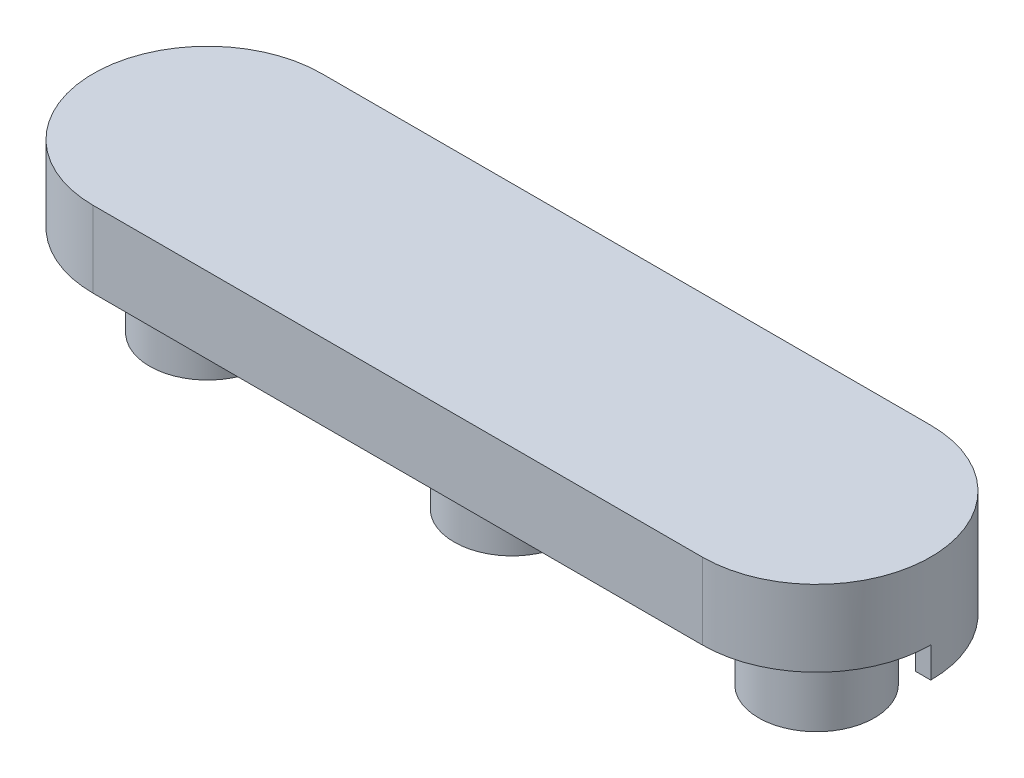
ISO-10303-21;
HEADER;
FILE_DESCRIPTION(('STEP AP214'),'2;1');
FILE_NAME('part.step','',(''),(''),'','','');
FILE_SCHEMA(('AUTOMOTIVE_DESIGN { 1 0 10303 214 1 1 1 1 }'));
ENDSEC;
DATA;
#1=APPLICATION_CONTEXT('core data for automotive mechanical design processes');
#2=APPLICATION_PROTOCOL_DEFINITION('international standard','automotive_design',2000,#1);
#3=PRODUCT_CONTEXT('',#1,'mechanical');
#4=PRODUCT('Part','Part','',(#3));
#5=PRODUCT_RELATED_PRODUCT_CATEGORY('part','',(#4));
#6=PRODUCT_DEFINITION_FORMATION('','',#4);
#7=PRODUCT_DEFINITION_CONTEXT('part definition',#1,'design');
#8=PRODUCT_DEFINITION('design','',#6,#7);
#9=PRODUCT_DEFINITION_SHAPE('','',#8);
#10=(LENGTH_UNIT() NAMED_UNIT(*) SI_UNIT(.MILLI.,.METRE.));
#11=(NAMED_UNIT(*) PLANE_ANGLE_UNIT() SI_UNIT($,.RADIAN.));
#12=(NAMED_UNIT(*) SI_UNIT($,.STERADIAN.) SOLID_ANGLE_UNIT());
#13=UNCERTAINTY_MEASURE_WITH_UNIT(LENGTH_MEASURE(1.E-05),#10,'distance_accuracy_value','');
#14=(GEOMETRIC_REPRESENTATION_CONTEXT(3) GLOBAL_UNCERTAINTY_ASSIGNED_CONTEXT((#13)) GLOBAL_UNIT_ASSIGNED_CONTEXT((#10,
#11,#12)) REPRESENTATION_CONTEXT('',''));
#15=CARTESIAN_POINT('',(0.,0.,0.));
#16=DIRECTION('',(0.,0.,1.));
#17=DIRECTION('',(1.,0.,0.));
#18=AXIS2_PLACEMENT_3D('',#15,#16,#17);
#19=CARTESIAN_POINT('',(-25.4,7.62,0.));
#20=DIRECTION('',(0.,1.,0.));
#21=DIRECTION('',(0.,0.,1.));
#22=AXIS2_PLACEMENT_3D('',#19,#20,#21);
#23=PLANE('',#22);
#24=CARTESIAN_POINT('',(-25.4,7.62,0.));
#25=DIRECTION('',(0.,1.,0.));
#26=DIRECTION('',(0.,0.,1.));
#27=AXIS2_PLACEMENT_3D('',#24,#25,#26);
#28=CIRCLE('',#27,4.826);
#29=CARTESIAN_POINT('',(-25.4,7.62,4.826));
#30=VERTEX_POINT('',#29);
#31=EDGE_CURVE('E160',#30,#30,#28,.F.);
#32=ORIENTED_EDGE('',*,*,#31,.F.);
#33=EDGE_LOOP('',(#32));
#34=FACE_BOUND('',#33,.T.);
#35=CARTESIAN_POINT('',(0.,7.62,0.));
#36=DIRECTION('',(0.,1.,0.));
#37=DIRECTION('',(0.,0.,1.));
#38=AXIS2_PLACEMENT_3D('',#35,#36,#37);
#39=CIRCLE('',#38,4.826);
#40=CARTESIAN_POINT('',(0.,7.62,4.826));
#41=VERTEX_POINT('',#40);
#42=EDGE_CURVE('E168',#41,#41,#39,.F.);
#43=ORIENTED_EDGE('',*,*,#42,.F.);
#44=EDGE_LOOP('',(#43));
#45=FACE_BOUND('',#44,.T.);
#46=CARTESIAN_POINT('',(25.4,7.62,0.));
#47=DIRECTION('',(0.,1.,0.));
#48=DIRECTION('',(0.,0.,1.));
#49=AXIS2_PLACEMENT_3D('',#46,#47,#48);
#50=CIRCLE('',#49,4.826);
#51=CARTESIAN_POINT('',(25.4,7.62,4.826));
#52=VERTEX_POINT('',#51);
#53=EDGE_CURVE('E12',#52,#52,#50,.F.);
#54=ORIENTED_EDGE('',*,*,#53,.F.);
#55=EDGE_LOOP('',(#54));
#56=FACE_BOUND('',#55,.T.);
#57=DIRECTION('',(-1.,0.,0.));
#58=VECTOR('',#57,1.);
#59=CARTESIAN_POINT('',(34.925,7.62,0.));
#60=LINE('',#59,#58);
#61=CARTESIAN_POINT('',(34.925,7.62,0.));
#62=VERTEX_POINT('',#61);
#63=CARTESIAN_POINT('',(33.655,7.62,0.));
#64=VERTEX_POINT('',#63);
#65=EDGE_CURVE('E544',#62,#64,#60,.T.);
#66=ORIENTED_EDGE('',*,*,#65,.F.);
#67=CARTESIAN_POINT('',(25.4,7.62,0.));
#68=DIRECTION('',(0.,1.,0.));
#69=DIRECTION('',(0.,0.,1.));
#70=AXIS2_PLACEMENT_3D('',#67,#68,#69);
#71=CIRCLE('',#70,9.525);
#72=CARTESIAN_POINT('',(25.4,7.62,9.525));
#73=VERTEX_POINT('',#72);
#74=EDGE_CURVE('E151',#73,#62,#71,.T.);
#75=ORIENTED_EDGE('',*,*,#74,.F.);
#76=DIRECTION('',(1.,0.,0.));
#77=VECTOR('',#76,1.);
#78=CARTESIAN_POINT('',(-25.4,7.62,9.525));
#79=LINE('',#78,#77);
#80=CARTESIAN_POINT('',(-25.4,7.62,9.525));
#81=VERTEX_POINT('',#80);
#82=EDGE_CURVE('E135',#81,#73,#79,.T.);
#83=ORIENTED_EDGE('',*,*,#82,.F.);
#84=CARTESIAN_POINT('',(-25.4,7.62,0.));
#85=DIRECTION('',(0.,1.,0.));
#86=DIRECTION('',(0.,0.,1.));
#87=AXIS2_PLACEMENT_3D('',#84,#85,#86);
#88=CIRCLE('',#87,9.525);
#89=CARTESIAN_POINT('',(-34.925,7.62,0.));
#90=VERTEX_POINT('',#89);
#91=EDGE_CURVE('E84',#90,#81,#88,.T.);
#92=ORIENTED_EDGE('',*,*,#91,.F.);
#93=DIRECTION('',(-1.,0.,0.));
#94=VECTOR('',#93,1.);
#95=CARTESIAN_POINT('',(-33.655,7.62,0.));
#96=LINE('',#95,#94);
#97=CARTESIAN_POINT('',(-33.655,7.62,0.));
#98=VERTEX_POINT('',#97);
#99=EDGE_CURVE('E518',#98,#90,#96,.T.);
#100=ORIENTED_EDGE('',*,*,#99,.F.);
#101=CARTESIAN_POINT('',(-25.4,7.62,0.));
#102=DIRECTION('',(0.,1.,0.));
#103=DIRECTION('',(0.,0.,1.));
#104=AXIS2_PLACEMENT_3D('',#101,#102,#103);
#105=CIRCLE('',#104,8.255);
#106=CARTESIAN_POINT('',(-25.4,7.62,-8.255));
#107=VERTEX_POINT('',#106);
#108=EDGE_CURVE('E538',#107,#98,#105,.T.);
#109=ORIENTED_EDGE('',*,*,#108,.F.);
#110=DIRECTION('',(-1.,0.,0.));
#111=VECTOR('',#110,1.);
#112=CARTESIAN_POINT('',(25.4,7.62,-8.255));
#113=LINE('',#112,#111);
#114=CARTESIAN_POINT('',(25.4,7.62,-8.255));
#115=VERTEX_POINT('',#114);
#116=EDGE_CURVE('E540',#115,#107,#113,.T.);
#117=ORIENTED_EDGE('',*,*,#116,.F.);
#118=CARTESIAN_POINT('',(25.4,7.62,0.));
#119=DIRECTION('',(0.,1.,0.));
#120=DIRECTION('',(0.,0.,-1.));
#121=AXIS2_PLACEMENT_3D('',#118,#119,#120);
#122=CIRCLE('',#121,8.255);
#123=EDGE_CURVE('E542',#64,#115,#122,.T.);
#124=ORIENTED_EDGE('',*,*,#123,.F.);
#125=EDGE_LOOP('',(#66,#75,#83,#92,#100,#109,#117,#124));
#126=FACE_BOUND('',#125,.T.);
#127=ADVANCED_FACE('F55',(#34,#45,#56,#126),#23,.F.);
#128=CARTESIAN_POINT('',(-25.4,7.62,0.));
#129=DIRECTION('',(0.,1.,0.));
#130=DIRECTION('',(0.,0.,1.));
#131=AXIS2_PLACEMENT_3D('',#128,#129,#130);
#132=CIRCLE('',#131,2.0955);
#133=CARTESIAN_POINT('',(-25.4,7.62,2.0955));
#134=VERTEX_POINT('',#133);
#135=EDGE_CURVE('E157',#134,#134,#132,.T.);
#136=ORIENTED_EDGE('',*,*,#135,.T.);
#137=EDGE_LOOP('',(#136));
#138=FACE_BOUND('',#137,.T.);
#139=CARTESIAN_POINT('',(-25.4,7.62,0.));
#140=DIRECTION('',(0.,1.,0.));
#141=DIRECTION('',(0.,0.,1.));
#142=AXIS2_PLACEMENT_3D('',#139,#140,#141);
#143=CIRCLE('',#142,3.1115);
#144=CARTESIAN_POINT('',(-25.4,7.62,3.1115));
#145=VERTEX_POINT('',#144);
#146=EDGE_CURVE('E149',#145,#145,#143,.T.);
#147=ORIENTED_EDGE('',*,*,#146,.F.);
#148=EDGE_LOOP('',(#147));
#149=FACE_BOUND('',#148,.T.);
#150=ADVANCED_FACE('F237',(#138,#149),#23,.F.);
#151=CARTESIAN_POINT('',(-25.4,7.62,0.));
#152=DIRECTION('',(0.,-1.,0.));
#153=DIRECTION('',(0.,0.,-1.));
#154=AXIS2_PLACEMENT_3D('',#151,#152,#153);
#155=CYLINDRICAL_SURFACE('',#154,2.0955);
#156=ORIENTED_EDGE('',*,*,#135,.F.);
#157=EDGE_LOOP('',(#156));
#158=FACE_BOUND('',#157,.T.);
#159=CARTESIAN_POINT('',(-25.4,0.,0.));
#160=DIRECTION('',(0.,1.,0.));
#161=DIRECTION('',(0.,0.,1.));
#162=AXIS2_PLACEMENT_3D('',#159,#160,#161);
#163=CIRCLE('',#162,2.0955);
#164=CARTESIAN_POINT('',(-25.4,0.,2.0955));
#165=VERTEX_POINT('',#164);
#166=EDGE_CURVE('E156',#165,#165,#163,.T.);
#167=ORIENTED_EDGE('',*,*,#166,.T.);
#168=EDGE_LOOP('',(#167));
#169=FACE_BOUND('',#168,.T.);
#170=ADVANCED_FACE('F57',(#158,#169),#155,.T.);
#171=CARTESIAN_POINT('',(0.,0.,0.));
#172=DIRECTION('',(0.,1.,0.));
#173=DIRECTION('',(0.,0.,1.));
#174=AXIS2_PLACEMENT_3D('',#171,#172,#173);
#175=PLANE('',#174);
#176=ORIENTED_EDGE('',*,*,#166,.F.);
#177=EDGE_LOOP('',(#176));
#178=FACE_BOUND('',#177,.T.);
#179=ADVANCED_FACE('F257',(#178),#175,.F.);
#180=CARTESIAN_POINT('',(-25.4,7.62,0.));
#181=DIRECTION('',(0.,-1.,0.));
#182=DIRECTION('',(0.,0.,-1.));
#183=AXIS2_PLACEMENT_3D('',#180,#181,#182);
#184=CYLINDRICAL_SURFACE('',#183,3.1115);
#185=ORIENTED_EDGE('',*,*,#146,.T.);
#186=EDGE_LOOP('',(#185));
#187=FACE_BOUND('',#186,.T.);
#188=CARTESIAN_POINT('',(-25.4,0.,0.));
#189=DIRECTION('',(0.,1.,0.));
#190=DIRECTION('',(0.,0.,1.));
#191=AXIS2_PLACEMENT_3D('',#188,#189,#190);
#192=CIRCLE('',#191,3.1115);
#193=CARTESIAN_POINT('',(-25.4,0.,3.1115));
#194=VERTEX_POINT('',#193);
#195=EDGE_CURVE('E212',#194,#194,#192,.T.);
#196=ORIENTED_EDGE('',*,*,#195,.F.);
#197=EDGE_LOOP('',(#196));
#198=FACE_BOUND('',#197,.T.);
#199=ADVANCED_FACE('F232',(#187,#198),#184,.F.);
#200=CARTESIAN_POINT('',(-25.4,7.62,0.));
#201=DIRECTION('',(0.,-1.,0.));
#202=DIRECTION('',(0.,0.,-1.));
#203=AXIS2_PLACEMENT_3D('',#200,#201,#202);
#204=CYLINDRICAL_SURFACE('',#203,4.826);
#205=ORIENTED_EDGE('',*,*,#31,.T.);
#206=EDGE_LOOP('',(#205));
#207=FACE_BOUND('',#206,.T.);
#208=CARTESIAN_POINT('',(-25.4,0.,0.));
#209=DIRECTION('',(0.,1.,0.));
#210=DIRECTION('',(0.,0.,1.));
#211=AXIS2_PLACEMENT_3D('',#208,#209,#210);
#212=CIRCLE('',#211,4.826);
#213=CARTESIAN_POINT('',(-25.4,0.,4.826));
#214=VERTEX_POINT('',#213);
#215=EDGE_CURVE('E215',#214,#214,#212,.T.);
#216=ORIENTED_EDGE('',*,*,#215,.T.);
#217=EDGE_LOOP('',(#216));
#218=FACE_BOUND('',#217,.T.);
#219=ADVANCED_FACE('F221',(#207,#218),#204,.T.);
#220=CARTESIAN_POINT('',(0.,0.,0.));
#221=DIRECTION('',(0.,1.,0.));
#222=DIRECTION('',(0.,0.,1.));
#223=AXIS2_PLACEMENT_3D('',#220,#221,#222);
#224=PLANE('',#223);
#225=ORIENTED_EDGE('',*,*,#195,.T.);
#226=EDGE_LOOP('',(#225));
#227=FACE_BOUND('',#226,.T.);
#228=ORIENTED_EDGE('',*,*,#215,.F.);
#229=EDGE_LOOP('',(#228));
#230=FACE_BOUND('',#229,.T.);
#231=ADVANCED_FACE('F223',(#227,#230),#224,.F.);
#232=CARTESIAN_POINT('',(-25.4,13.97,0.));
#233=DIRECTION('',(0.,1.,0.));
#234=DIRECTION('',(0.,0.,1.));
#235=AXIS2_PLACEMENT_3D('',#232,#233,#234);
#236=PLANE('',#235);
#237=CARTESIAN_POINT('',(-25.4,13.97,0.));
#238=DIRECTION('',(0.,1.,0.));
#239=DIRECTION('',(0.,0.,1.));
#240=AXIS2_PLACEMENT_3D('',#237,#238,#239);
#241=CIRCLE('',#240,9.525);
#242=CARTESIAN_POINT('',(-25.4,13.97,-9.525));
#243=VERTEX_POINT('',#242);
#244=CARTESIAN_POINT('',(-25.4,13.97,9.525));
#245=VERTEX_POINT('',#244);
#246=EDGE_CURVE('E128',#243,#245,#241,.T.);
#247=ORIENTED_EDGE('',*,*,#246,.T.);
#248=DIRECTION('',(1.,0.,0.));
#249=VECTOR('',#248,1.);
#250=CARTESIAN_POINT('',(-25.4,13.97,9.525));
#251=LINE('',#250,#249);
#252=CARTESIAN_POINT('',(25.4,13.97,9.525));
#253=VERTEX_POINT('',#252);
#254=EDGE_CURVE('E122',#245,#253,#251,.T.);
#255=ORIENTED_EDGE('',*,*,#254,.T.);
#256=CARTESIAN_POINT('',(25.4,13.97,0.));
#257=DIRECTION('',(0.,1.,0.));
#258=DIRECTION('',(0.,0.,1.));
#259=AXIS2_PLACEMENT_3D('',#256,#257,#258);
#260=CIRCLE('',#259,9.525);
#261=CARTESIAN_POINT('',(25.4,13.97,-9.525));
#262=VERTEX_POINT('',#261);
#263=EDGE_CURVE('E126',#253,#262,#260,.T.);
#264=ORIENTED_EDGE('',*,*,#263,.T.);
#265=DIRECTION('',(-1.,0.,0.));
#266=VECTOR('',#265,1.);
#267=CARTESIAN_POINT('',(-25.4,13.97,-9.525));
#268=LINE('',#267,#266);
#269=EDGE_CURVE('E72',#262,#243,#268,.T.);
#270=ORIENTED_EDGE('',*,*,#269,.T.);
#271=EDGE_LOOP('',(#247,#255,#264,#270));
#272=FACE_BOUND('',#271,.T.);
#273=ADVANCED_FACE('F124',(#272),#236,.T.);
#274=CARTESIAN_POINT('',(-25.4,13.97,9.525));
#275=DIRECTION('',(0.,0.,-1.));
#276=DIRECTION('',(-1.,0.,0.));
#277=AXIS2_PLACEMENT_3D('',#274,#275,#276);
#278=PLANE('',#277);
#279=ORIENTED_EDGE('',*,*,#82,.T.);
#280=DIRECTION('',(0.,-1.,0.));
#281=VECTOR('',#280,1.);
#282=CARTESIAN_POINT('',(25.4,13.97,9.525));
#283=LINE('',#282,#281);
#284=EDGE_CURVE('E133',#253,#73,#283,.T.);
#285=ORIENTED_EDGE('',*,*,#284,.F.);
#286=ORIENTED_EDGE('',*,*,#254,.F.);
#287=DIRECTION('',(0.,-1.,0.));
#288=VECTOR('',#287,1.);
#289=CARTESIAN_POINT('',(-25.4,13.97,9.525));
#290=LINE('',#289,#288);
#291=EDGE_CURVE('E139',#245,#81,#290,.T.);
#292=ORIENTED_EDGE('',*,*,#291,.T.);
#293=EDGE_LOOP('',(#279,#285,#286,#292));
#294=FACE_BOUND('',#293,.T.);
#295=ADVANCED_FACE('F134',(#294),#278,.F.);
#296=CARTESIAN_POINT('',(25.4,13.97,0.));
#297=DIRECTION('',(0.,-1.,0.));
#298=DIRECTION('',(0.,0.,-1.));
#299=AXIS2_PLACEMENT_3D('',#296,#297,#298);
#300=CYLINDRICAL_SURFACE('',#299,9.525);
#301=ORIENTED_EDGE('',*,*,#74,.T.);
#302=DIRECTION('',(0.,1.,0.));
#303=VECTOR('',#302,1.);
#304=CARTESIAN_POINT('',(34.925,5.08,0.));
#305=LINE('',#304,#303);
#306=CARTESIAN_POINT('',(34.925,5.08,0.));
#307=VERTEX_POINT('',#306);
#308=EDGE_CURVE('E197',#307,#62,#305,.T.);
#309=ORIENTED_EDGE('',*,*,#308,.F.);
#310=CARTESIAN_POINT('',(25.4,5.08,0.));
#311=DIRECTION('',(0.,-1.,0.));
#312=DIRECTION('',(0.,0.,-1.));
#313=AXIS2_PLACEMENT_3D('',#310,#311,#312);
#314=CIRCLE('',#313,9.525);
#315=CARTESIAN_POINT('',(25.4,5.08,-9.525));
#316=VERTEX_POINT('',#315);
#317=EDGE_CURVE('E508',#316,#307,#314,.T.);
#318=ORIENTED_EDGE('',*,*,#317,.F.);
#319=DIRECTION('',(0.,-1.,0.));
#320=VECTOR('',#319,1.);
#321=CARTESIAN_POINT('',(25.4,13.97,-9.525));
#322=LINE('',#321,#320);
#323=EDGE_CURVE('E94',#262,#316,#322,.T.);
#324=ORIENTED_EDGE('',*,*,#323,.F.);
#325=ORIENTED_EDGE('',*,*,#263,.F.);
#326=ORIENTED_EDGE('',*,*,#284,.T.);
#327=EDGE_LOOP('',(#301,#309,#318,#324,#325,#326));
#328=FACE_BOUND('',#327,.T.);
#329=ADVANCED_FACE('F141',(#328),#300,.T.);
#330=CARTESIAN_POINT('',(-25.4,13.97,-9.525));
#331=DIRECTION('',(0.,0.,1.));
#332=DIRECTION('',(1.,0.,0.));
#333=AXIS2_PLACEMENT_3D('',#330,#331,#332);
#334=PLANE('',#333);
#335=ORIENTED_EDGE('',*,*,#323,.T.);
#336=DIRECTION('',(1.,0.,0.));
#337=VECTOR('',#336,1.);
#338=CARTESIAN_POINT('',(25.4,5.08,-9.525));
#339=LINE('',#338,#337);
#340=CARTESIAN_POINT('',(-25.4,5.08,-9.525));
#341=VERTEX_POINT('',#340);
#342=EDGE_CURVE('E516',#341,#316,#339,.T.);
#343=ORIENTED_EDGE('',*,*,#342,.F.);
#344=DIRECTION('',(0.,-1.,0.));
#345=VECTOR('',#344,1.);
#346=CARTESIAN_POINT('',(-25.4,13.97,-9.525));
#347=LINE('',#346,#345);
#348=EDGE_CURVE('E144',#243,#341,#347,.T.);
#349=ORIENTED_EDGE('',*,*,#348,.F.);
#350=ORIENTED_EDGE('',*,*,#269,.F.);
#351=EDGE_LOOP('',(#335,#343,#349,#350));
#352=FACE_BOUND('',#351,.T.);
#353=ADVANCED_FACE('F247',(#352),#334,.F.);
#354=CARTESIAN_POINT('',(-25.4,13.97,0.));
#355=DIRECTION('',(0.,-1.,0.));
#356=DIRECTION('',(0.,0.,-1.));
#357=AXIS2_PLACEMENT_3D('',#354,#355,#356);
#358=CYLINDRICAL_SURFACE('',#357,9.525);
#359=ORIENTED_EDGE('',*,*,#348,.T.);
#360=CARTESIAN_POINT('',(-25.4,5.08,0.));
#361=DIRECTION('',(0.,-1.,0.));
#362=DIRECTION('',(0.,0.,1.));
#363=AXIS2_PLACEMENT_3D('',#360,#361,#362);
#364=CIRCLE('',#363,9.525);
#365=CARTESIAN_POINT('',(-34.925,5.08,0.));
#366=VERTEX_POINT('',#365);
#367=EDGE_CURVE('E547',#366,#341,#364,.T.);
#368=ORIENTED_EDGE('',*,*,#367,.F.);
#369=DIRECTION('',(0.,1.,0.));
#370=VECTOR('',#369,1.);
#371=CARTESIAN_POINT('',(-34.925,5.08,0.));
#372=LINE('',#371,#370);
#373=EDGE_CURVE('E535',#366,#90,#372,.T.);
#374=ORIENTED_EDGE('',*,*,#373,.T.);
#375=ORIENTED_EDGE('',*,*,#91,.T.);
#376=ORIENTED_EDGE('',*,*,#291,.F.);
#377=ORIENTED_EDGE('',*,*,#246,.F.);
#378=EDGE_LOOP('',(#359,#368,#374,#375,#376,#377));
#379=FACE_BOUND('',#378,.T.);
#380=ADVANCED_FACE('F250',(#379),#358,.T.);
#381=CARTESIAN_POINT('',(0.,7.62,0.));
#382=DIRECTION('',(0.,-1.,0.));
#383=DIRECTION('',(0.,0.,-1.));
#384=AXIS2_PLACEMENT_3D('',#381,#382,#383);
#385=CYLINDRICAL_SURFACE('',#384,3.1115);
#386=CARTESIAN_POINT('',(0.,7.62,0.));
#387=DIRECTION('',(0.,1.,0.));
#388=DIRECTION('',(0.,0.,1.));
#389=AXIS2_PLACEMENT_3D('',#386,#387,#388);
#390=CIRCLE('',#389,3.1115);
#391=CARTESIAN_POINT('',(0.,7.62,3.1115));
#392=VERTEX_POINT('',#391);
#393=EDGE_CURVE('E201',#392,#392,#390,.T.);
#394=ORIENTED_EDGE('',*,*,#393,.T.);
#395=EDGE_LOOP('',(#394));
#396=FACE_BOUND('',#395,.T.);
#397=CARTESIAN_POINT('',(0.,0.,0.));
#398=DIRECTION('',(0.,1.,0.));
#399=DIRECTION('',(0.,0.,1.));
#400=AXIS2_PLACEMENT_3D('',#397,#398,#399);
#401=CIRCLE('',#400,3.1115);
#402=CARTESIAN_POINT('',(0.,0.,3.1115));
#403=VERTEX_POINT('',#402);
#404=EDGE_CURVE('E190',#403,#403,#401,.T.);
#405=ORIENTED_EDGE('',*,*,#404,.F.);
#406=EDGE_LOOP('',(#405));
#407=FACE_BOUND('',#406,.T.);
#408=ADVANCED_FACE('F256',(#396,#407),#385,.F.);
#409=CARTESIAN_POINT('',(0.,7.62,0.));
#410=DIRECTION('',(0.,-1.,0.));
#411=DIRECTION('',(0.,0.,-1.));
#412=AXIS2_PLACEMENT_3D('',#409,#410,#411);
#413=CYLINDRICAL_SURFACE('',#412,4.826);
#414=ORIENTED_EDGE('',*,*,#42,.T.);
#415=EDGE_LOOP('',(#414));
#416=FACE_BOUND('',#415,.T.);
#417=CARTESIAN_POINT('',(0.,0.,0.));
#418=DIRECTION('',(0.,1.,0.));
#419=DIRECTION('',(0.,0.,1.));
#420=AXIS2_PLACEMENT_3D('',#417,#418,#419);
#421=CIRCLE('',#420,4.826);
#422=CARTESIAN_POINT('',(0.,0.,4.826));
#423=VERTEX_POINT('',#422);
#424=EDGE_CURVE('E205',#423,#423,#421,.T.);
#425=ORIENTED_EDGE('',*,*,#424,.T.);
#426=EDGE_LOOP('',(#425));
#427=FACE_BOUND('',#426,.T.);
#428=ADVANCED_FACE('F321',(#416,#427),#413,.T.);
#429=CARTESIAN_POINT('',(0.,0.,0.));
#430=DIRECTION('',(0.,1.,0.));
#431=DIRECTION('',(0.,0.,1.));
#432=AXIS2_PLACEMENT_3D('',#429,#430,#431);
#433=PLANE('',#432);
#434=ORIENTED_EDGE('',*,*,#404,.T.);
#435=EDGE_LOOP('',(#434));
#436=FACE_BOUND('',#435,.T.);
#437=ORIENTED_EDGE('',*,*,#424,.F.);
#438=EDGE_LOOP('',(#437));
#439=FACE_BOUND('',#438,.T.);
#440=ADVANCED_FACE('F332',(#436,#439),#433,.F.);
#441=CARTESIAN_POINT('',(0.,0.,0.));
#442=DIRECTION('',(0.,1.,0.));
#443=DIRECTION('',(0.,0.,1.));
#444=AXIS2_PLACEMENT_3D('',#441,#442,#443);
#445=PLANE('',#444);
#446=CARTESIAN_POINT('',(0.,0.,0.));
#447=DIRECTION('',(0.,1.,0.));
#448=DIRECTION('',(0.,0.,1.));
#449=AXIS2_PLACEMENT_3D('',#446,#447,#448);
#450=CIRCLE('',#449,2.0955);
#451=CARTESIAN_POINT('',(0.,0.,2.0955));
#452=VERTEX_POINT('',#451);
#453=EDGE_CURVE('E204',#452,#452,#450,.T.);
#454=ORIENTED_EDGE('',*,*,#453,.F.);
#455=EDGE_LOOP('',(#454));
#456=FACE_BOUND('',#455,.T.);
#457=ADVANCED_FACE('F342',(#456),#445,.F.);
#458=CARTESIAN_POINT('',(0.,7.62,0.));
#459=DIRECTION('',(0.,-1.,0.));
#460=DIRECTION('',(0.,0.,-1.));
#461=AXIS2_PLACEMENT_3D('',#458,#459,#460);
#462=CYLINDRICAL_SURFACE('',#461,2.0955);
#463=CARTESIAN_POINT('',(0.,7.62,0.));
#464=DIRECTION('',(0.,1.,0.));
#465=DIRECTION('',(0.,0.,1.));
#466=AXIS2_PLACEMENT_3D('',#463,#464,#465);
#467=CIRCLE('',#466,2.0955);
#468=CARTESIAN_POINT('',(0.,7.62,2.0955));
#469=VERTEX_POINT('',#468);
#470=EDGE_CURVE('E165',#469,#469,#467,.F.);
#471=ORIENTED_EDGE('',*,*,#470,.T.);
#472=EDGE_LOOP('',(#471));
#473=FACE_BOUND('',#472,.T.);
#474=ORIENTED_EDGE('',*,*,#453,.T.);
#475=EDGE_LOOP('',(#474));
#476=FACE_BOUND('',#475,.T.);
#477=ADVANCED_FACE('F352',(#473,#476),#462,.T.);
#478=ORIENTED_EDGE('',*,*,#470,.F.);
#479=EDGE_LOOP('',(#478));
#480=FACE_BOUND('',#479,.T.);
#481=ORIENTED_EDGE('',*,*,#393,.F.);
#482=EDGE_LOOP('',(#481));
#483=FACE_BOUND('',#482,.T.);
#484=ADVANCED_FACE('F181',(#480,#483),#23,.F.);
#485=CARTESIAN_POINT('',(25.4,7.62,0.));
#486=DIRECTION('',(0.,-1.,0.));
#487=DIRECTION('',(0.,0.,-1.));
#488=AXIS2_PLACEMENT_3D('',#485,#486,#487);
#489=CYLINDRICAL_SURFACE('',#488,3.1115);
#490=CARTESIAN_POINT('',(25.4,7.62,0.));
#491=DIRECTION('',(0.,1.,0.));
#492=DIRECTION('',(0.,0.,1.));
#493=AXIS2_PLACEMENT_3D('',#490,#491,#492);
#494=CIRCLE('',#493,3.1115);
#495=CARTESIAN_POINT('',(25.4,7.62,3.1115));
#496=VERTEX_POINT('',#495);
#497=EDGE_CURVE('E184',#496,#496,#494,.T.);
#498=ORIENTED_EDGE('',*,*,#497,.T.);
#499=EDGE_LOOP('',(#498));
#500=FACE_BOUND('',#499,.T.);
#501=CARTESIAN_POINT('',(25.4,0.,0.));
#502=DIRECTION('',(0.,1.,0.));
#503=DIRECTION('',(0.,0.,1.));
#504=AXIS2_PLACEMENT_3D('',#501,#502,#503);
#505=CIRCLE('',#504,3.1115);
#506=CARTESIAN_POINT('',(25.4,0.,3.1115));
#507=VERTEX_POINT('',#506);
#508=EDGE_CURVE('E193',#507,#507,#505,.T.);
#509=ORIENTED_EDGE('',*,*,#508,.F.);
#510=EDGE_LOOP('',(#509));
#511=FACE_BOUND('',#510,.T.);
#512=ADVANCED_FACE('F369',(#500,#511),#489,.F.);
#513=CARTESIAN_POINT('',(25.4,7.62,0.));
#514=DIRECTION('',(0.,-1.,0.));
#515=DIRECTION('',(0.,0.,-1.));
#516=AXIS2_PLACEMENT_3D('',#513,#514,#515);
#517=CYLINDRICAL_SURFACE('',#516,4.826);
#518=ORIENTED_EDGE('',*,*,#53,.T.);
#519=EDGE_LOOP('',(#518));
#520=FACE_BOUND('',#519,.T.);
#521=CARTESIAN_POINT('',(25.4,0.,0.));
#522=DIRECTION('',(0.,1.,0.));
#523=DIRECTION('',(0.,0.,1.));
#524=AXIS2_PLACEMENT_3D('',#521,#522,#523);
#525=CIRCLE('',#524,4.826);
#526=CARTESIAN_POINT('',(25.4,0.,4.826));
#527=VERTEX_POINT('',#526);
#528=EDGE_CURVE('E187',#527,#527,#525,.T.);
#529=ORIENTED_EDGE('',*,*,#528,.T.);
#530=EDGE_LOOP('',(#529));
#531=FACE_BOUND('',#530,.T.);
#532=ADVANCED_FACE('F380',(#520,#531),#517,.T.);
#533=CARTESIAN_POINT('',(0.,0.,0.));
#534=DIRECTION('',(0.,1.,0.));
#535=DIRECTION('',(0.,0.,1.));
#536=AXIS2_PLACEMENT_3D('',#533,#534,#535);
#537=PLANE('',#536);
#538=ORIENTED_EDGE('',*,*,#508,.T.);
#539=EDGE_LOOP('',(#538));
#540=FACE_BOUND('',#539,.T.);
#541=ORIENTED_EDGE('',*,*,#528,.F.);
#542=EDGE_LOOP('',(#541));
#543=FACE_BOUND('',#542,.T.);
#544=ADVANCED_FACE('F390',(#540,#543),#537,.F.);
#545=CARTESIAN_POINT('',(0.,0.,0.));
#546=DIRECTION('',(0.,1.,0.));
#547=DIRECTION('',(0.,0.,1.));
#548=AXIS2_PLACEMENT_3D('',#545,#546,#547);
#549=PLANE('',#548);
#550=CARTESIAN_POINT('',(25.4,0.,0.));
#551=DIRECTION('',(0.,1.,0.));
#552=DIRECTION('',(0.,0.,1.));
#553=AXIS2_PLACEMENT_3D('',#550,#551,#552);
#554=CIRCLE('',#553,2.0955);
#555=CARTESIAN_POINT('',(25.4,0.,2.0955));
#556=VERTEX_POINT('',#555);
#557=EDGE_CURVE('E186',#556,#556,#554,.T.);
#558=ORIENTED_EDGE('',*,*,#557,.F.);
#559=EDGE_LOOP('',(#558));
#560=FACE_BOUND('',#559,.T.);
#561=ADVANCED_FACE('F399',(#560),#549,.F.);
#562=CARTESIAN_POINT('',(25.4,7.62,0.));
#563=DIRECTION('',(0.,-1.,0.));
#564=DIRECTION('',(0.,0.,-1.));
#565=AXIS2_PLACEMENT_3D('',#562,#563,#564);
#566=CYLINDRICAL_SURFACE('',#565,2.0955);
#567=CARTESIAN_POINT('',(25.4,7.62,0.));
#568=DIRECTION('',(0.,1.,0.));
#569=DIRECTION('',(0.,0.,1.));
#570=AXIS2_PLACEMENT_3D('',#567,#568,#569);
#571=CIRCLE('',#570,2.0955);
#572=CARTESIAN_POINT('',(25.4,7.62,2.0955));
#573=VERTEX_POINT('',#572);
#574=EDGE_CURVE('E64',#573,#573,#571,.F.);
#575=ORIENTED_EDGE('',*,*,#574,.T.);
#576=EDGE_LOOP('',(#575));
#577=FACE_BOUND('',#576,.T.);
#578=ORIENTED_EDGE('',*,*,#557,.T.);
#579=EDGE_LOOP('',(#578));
#580=FACE_BOUND('',#579,.T.);
#581=ADVANCED_FACE('F173',(#577,#580),#566,.T.);
#582=ORIENTED_EDGE('',*,*,#574,.F.);
#583=EDGE_LOOP('',(#582));
#584=FACE_BOUND('',#583,.T.);
#585=ORIENTED_EDGE('',*,*,#497,.F.);
#586=EDGE_LOOP('',(#585));
#587=FACE_BOUND('',#586,.T.);
#588=ADVANCED_FACE('F176',(#584,#587),#23,.F.);
#589=CARTESIAN_POINT('',(34.925,5.08,0.));
#590=DIRECTION('',(0.,0.,-1.));
#591=DIRECTION('',(-1.,0.,0.));
#592=AXIS2_PLACEMENT_3D('',#589,#590,#591);
#593=PLANE('',#592);
#594=ORIENTED_EDGE('',*,*,#65,.T.);
#595=DIRECTION('',(0.,1.,0.));
#596=VECTOR('',#595,1.);
#597=CARTESIAN_POINT('',(33.655,5.08,0.));
#598=LINE('',#597,#596);
#599=CARTESIAN_POINT('',(33.655,5.08,0.));
#600=VERTEX_POINT('',#599);
#601=EDGE_CURVE('E521',#600,#64,#598,.T.);
#602=ORIENTED_EDGE('',*,*,#601,.F.);
#603=DIRECTION('',(-1.,0.,0.));
#604=VECTOR('',#603,1.);
#605=CARTESIAN_POINT('',(34.925,5.08,0.));
#606=LINE('',#605,#604);
#607=EDGE_CURVE('E513',#307,#600,#606,.T.);
#608=ORIENTED_EDGE('',*,*,#607,.F.);
#609=ORIENTED_EDGE('',*,*,#308,.T.);
#610=EDGE_LOOP('',(#594,#602,#608,#609));
#611=FACE_BOUND('',#610,.T.);
#612=ADVANCED_FACE('F179',(#611),#593,.F.);
#613=CARTESIAN_POINT('',(25.4,5.08,0.));
#614=DIRECTION('',(0.,1.,0.));
#615=DIRECTION('',(0.,0.,1.));
#616=AXIS2_PLACEMENT_3D('',#613,#614,#615);
#617=CYLINDRICAL_SURFACE('',#616,8.255);
#618=ORIENTED_EDGE('',*,*,#123,.T.);
#619=DIRECTION('',(0.,1.,0.));
#620=VECTOR('',#619,1.);
#621=CARTESIAN_POINT('',(25.4,5.08,-8.255));
#622=LINE('',#621,#620);
#623=CARTESIAN_POINT('',(25.4,5.08,-8.255));
#624=VERTEX_POINT('',#623);
#625=EDGE_CURVE('E523',#624,#115,#622,.T.);
#626=ORIENTED_EDGE('',*,*,#625,.F.);
#627=CARTESIAN_POINT('',(25.4,5.08,0.));
#628=DIRECTION('',(0.,1.,0.));
#629=DIRECTION('',(0.,0.,-1.));
#630=AXIS2_PLACEMENT_3D('',#627,#628,#629);
#631=CIRCLE('',#630,8.255);
#632=EDGE_CURVE('E558',#600,#624,#631,.T.);
#633=ORIENTED_EDGE('',*,*,#632,.F.);
#634=ORIENTED_EDGE('',*,*,#601,.T.);
#635=EDGE_LOOP('',(#618,#626,#633,#634));
#636=FACE_BOUND('',#635,.T.);
#637=ADVANCED_FACE('F452',(#636),#617,.F.);
#638=CARTESIAN_POINT('',(25.4,5.08,-8.255));
#639=DIRECTION('',(0.,0.,-1.));
#640=DIRECTION('',(-1.,0.,0.));
#641=AXIS2_PLACEMENT_3D('',#638,#639,#640);
#642=PLANE('',#641);
#643=ORIENTED_EDGE('',*,*,#116,.T.);
#644=DIRECTION('',(0.,1.,0.));
#645=VECTOR('',#644,1.);
#646=CARTESIAN_POINT('',(-25.4,5.08,-8.255));
#647=LINE('',#646,#645);
#648=CARTESIAN_POINT('',(-25.4,5.08,-8.255));
#649=VERTEX_POINT('',#648);
#650=EDGE_CURVE('E527',#649,#107,#647,.T.);
#651=ORIENTED_EDGE('',*,*,#650,.F.);
#652=DIRECTION('',(-1.,0.,0.));
#653=VECTOR('',#652,1.);
#654=CARTESIAN_POINT('',(25.4,5.08,-8.255));
#655=LINE('',#654,#653);
#656=EDGE_CURVE('E555',#624,#649,#655,.T.);
#657=ORIENTED_EDGE('',*,*,#656,.F.);
#658=ORIENTED_EDGE('',*,*,#625,.T.);
#659=EDGE_LOOP('',(#643,#651,#657,#658));
#660=FACE_BOUND('',#659,.T.);
#661=ADVANCED_FACE('F462',(#660),#642,.F.);
#662=CARTESIAN_POINT('',(-25.4,5.08,0.));
#663=DIRECTION('',(0.,1.,0.));
#664=DIRECTION('',(0.,0.,1.));
#665=AXIS2_PLACEMENT_3D('',#662,#663,#664);
#666=CYLINDRICAL_SURFACE('',#665,8.255);
#667=ORIENTED_EDGE('',*,*,#108,.T.);
#668=DIRECTION('',(0.,1.,0.));
#669=VECTOR('',#668,1.);
#670=CARTESIAN_POINT('',(-33.655,5.08,0.));
#671=LINE('',#670,#669);
#672=CARTESIAN_POINT('',(-33.655,5.08,0.));
#673=VERTEX_POINT('',#672);
#674=EDGE_CURVE('E532',#673,#98,#671,.T.);
#675=ORIENTED_EDGE('',*,*,#674,.F.);
#676=CARTESIAN_POINT('',(-25.4,5.08,0.));
#677=DIRECTION('',(0.,1.,0.));
#678=DIRECTION('',(0.,0.,1.));
#679=AXIS2_PLACEMENT_3D('',#676,#677,#678);
#680=CIRCLE('',#679,8.255);
#681=EDGE_CURVE('E552',#649,#673,#680,.T.);
#682=ORIENTED_EDGE('',*,*,#681,.F.);
#683=ORIENTED_EDGE('',*,*,#650,.T.);
#684=EDGE_LOOP('',(#667,#675,#682,#683));
#685=FACE_BOUND('',#684,.T.);
#686=ADVANCED_FACE('F472',(#685),#666,.F.);
#687=CARTESIAN_POINT('',(-33.655,5.08,0.));
#688=DIRECTION('',(0.,0.,-1.));
#689=DIRECTION('',(-1.,0.,0.));
#690=AXIS2_PLACEMENT_3D('',#687,#688,#689);
#691=PLANE('',#690);
#692=ORIENTED_EDGE('',*,*,#99,.T.);
#693=ORIENTED_EDGE('',*,*,#373,.F.);
#694=DIRECTION('',(-1.,0.,0.));
#695=VECTOR('',#694,1.);
#696=CARTESIAN_POINT('',(-33.655,5.08,0.));
#697=LINE('',#696,#695);
#698=EDGE_CURVE('E549',#673,#366,#697,.T.);
#699=ORIENTED_EDGE('',*,*,#698,.F.);
#700=ORIENTED_EDGE('',*,*,#674,.T.);
#701=EDGE_LOOP('',(#692,#693,#699,#700));
#702=FACE_BOUND('',#701,.T.);
#703=ADVANCED_FACE('F482',(#702),#691,.F.);
#704=CARTESIAN_POINT('',(25.4,5.08,0.));
#705=DIRECTION('',(0.,-1.,0.));
#706=DIRECTION('',(0.,0.,-1.));
#707=AXIS2_PLACEMENT_3D('',#704,#705,#706);
#708=PLANE('',#707);
#709=ORIENTED_EDGE('',*,*,#317,.T.);
#710=ORIENTED_EDGE('',*,*,#607,.T.);
#711=ORIENTED_EDGE('',*,*,#632,.T.);
#712=ORIENTED_EDGE('',*,*,#656,.T.);
#713=ORIENTED_EDGE('',*,*,#681,.T.);
#714=ORIENTED_EDGE('',*,*,#698,.T.);
#715=ORIENTED_EDGE('',*,*,#367,.T.);
#716=ORIENTED_EDGE('',*,*,#342,.T.);
#717=EDGE_LOOP('',(#709,#710,#711,#712,#713,#714,#715,#716));
#718=FACE_BOUND('',#717,.T.);
#719=ADVANCED_FACE('F492',(#718),#708,.T.);
#720=CLOSED_SHELL('',(#127,#150,#170,#179,#199,#219,#231,#273,#295,#329,#353,#380,#408,#428,
#440,#457,#477,#484,#512,#532,#544,#561,#581,#588,#612,#637,#661,#686,#703,#719));
#721=MANIFOLD_SOLID_BREP('B2',#720);
#722=ADVANCED_BREP_SHAPE_REPRESENTATION('',(#18,#721),#14);
#723=SHAPE_DEFINITION_REPRESENTATION(#9,#722);
ENDSEC;
END-ISO-10303-21;
